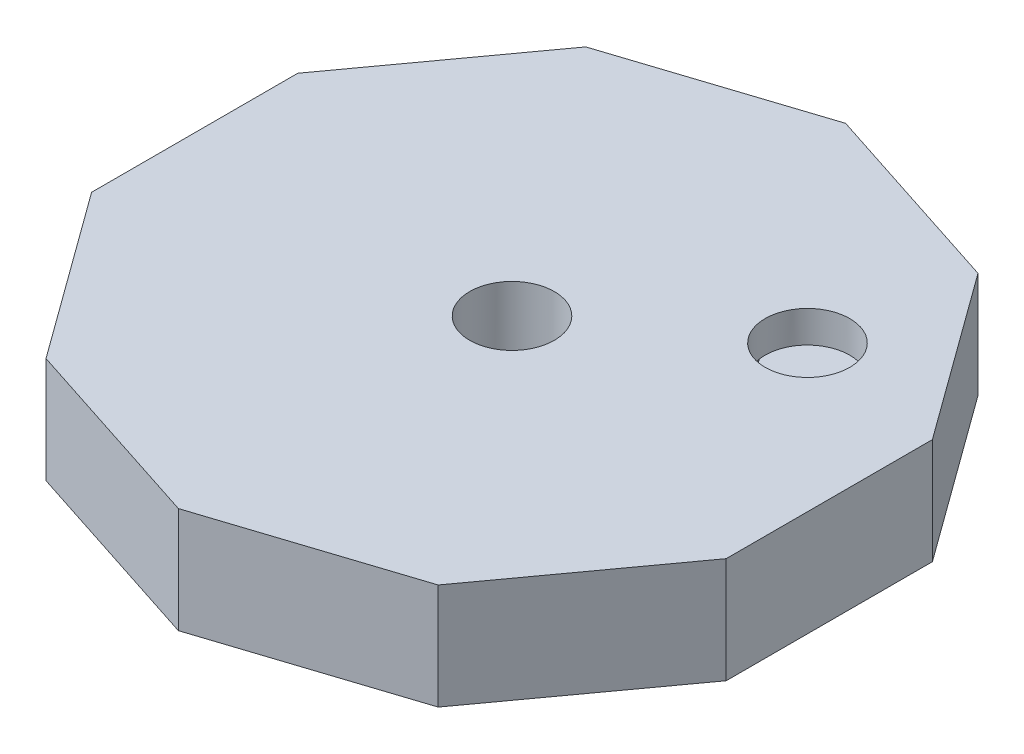
ISO-10303-21;
HEADER;
FILE_DESCRIPTION(('STEP AP214'),'2;1');
FILE_NAME('part.step','',(''),(''),'','','');
FILE_SCHEMA(('AUTOMOTIVE_DESIGN { 1 0 10303 214 1 1 1 1 }'));
ENDSEC;
DATA;
#1=APPLICATION_CONTEXT('core data for automotive mechanical design processes');
#2=APPLICATION_PROTOCOL_DEFINITION('international standard','automotive_design',2000,#1);
#3=PRODUCT_CONTEXT('',#1,'mechanical');
#4=PRODUCT('Part','Part','',(#3));
#5=PRODUCT_RELATED_PRODUCT_CATEGORY('part','',(#4));
#6=PRODUCT_DEFINITION_FORMATION('','',#4);
#7=PRODUCT_DEFINITION_CONTEXT('part definition',#1,'design');
#8=PRODUCT_DEFINITION('design','',#6,#7);
#9=PRODUCT_DEFINITION_SHAPE('','',#8);
#10=(LENGTH_UNIT() NAMED_UNIT(*) SI_UNIT(.MILLI.,.METRE.));
#11=(NAMED_UNIT(*) PLANE_ANGLE_UNIT() SI_UNIT($,.RADIAN.));
#12=(NAMED_UNIT(*) SI_UNIT($,.STERADIAN.) SOLID_ANGLE_UNIT());
#13=UNCERTAINTY_MEASURE_WITH_UNIT(LENGTH_MEASURE(1.E-05),#10,'distance_accuracy_value','');
#14=(GEOMETRIC_REPRESENTATION_CONTEXT(3) GLOBAL_UNCERTAINTY_ASSIGNED_CONTEXT((#13)) GLOBAL_UNIT_ASSIGNED_CONTEXT((#10,
#11,#12)) REPRESENTATION_CONTEXT('',''));
#15=CARTESIAN_POINT('',(0.,0.,0.));
#16=DIRECTION('',(0.,0.,1.));
#17=DIRECTION('',(1.,0.,0.));
#18=AXIS2_PLACEMENT_3D('',#15,#16,#17);
#19=CARTESIAN_POINT('',(12.360679774998,3.,0.));
#20=DIRECTION('',(0.,-1.,0.));
#21=DIRECTION('',(0.,0.,-1.));
#22=AXIS2_PLACEMENT_3D('',#19,#20,#21);
#23=PLANE('',#22);
#24=CARTESIAN_POINT('',(12.360679774998,3.,0.));
#25=DIRECTION('',(0.,-1.,0.));
#26=DIRECTION('',(0.,0.,-1.));
#27=AXIS2_PLACEMENT_3D('',#24,#25,#26);
#28=CIRCLE('',#27,2.);
#29=CARTESIAN_POINT('',(13.9787137637479,3.,-1.17557050458495));
#30=VERTEX_POINT('',#29);
#31=CARTESIAN_POINT('',(10.7426457862481,3.,1.17557050458495));
#32=VERTEX_POINT('',#31);
#33=EDGE_CURVE('E217',#30,#32,#28,.T.);
#34=ORIENTED_EDGE('',*,*,#33,.T.);
#35=DIRECTION('',(0.809016994374947,0.,-0.587785252292473));
#36=VECTOR('',#35,1.);
#37=CARTESIAN_POINT('',(12.360679774998,3.,0.));
#38=LINE('',#37,#36);
#39=EDGE_CURVE('E351',#32,#30,#38,.T.);
#40=ORIENTED_EDGE('',*,*,#39,.T.);
#41=EDGE_LOOP('',(#34,#40));
#42=FACE_BOUND('',#41,.T.);
#43=ADVANCED_FACE('F39',(#42),#23,.T.);
#44=CARTESIAN_POINT('',(0.,0.,0.));
#45=DIRECTION('',(0.,1.,0.));
#46=DIRECTION('',(0.,0.,1.));
#47=AXIS2_PLACEMENT_3D('',#44,#45,#46);
#48=CYLINDRICAL_SURFACE('',#47,2.);
#49=CARTESIAN_POINT('',(0.,5.,0.));
#50=DIRECTION('',(0.,1.,0.));
#51=DIRECTION('',(0.,0.,1.));
#52=AXIS2_PLACEMENT_3D('',#49,#50,#51);
#53=CIRCLE('',#52,2.);
#54=CARTESIAN_POINT('',(0.,5.,2.));
#55=VERTEX_POINT('',#54);
#56=EDGE_CURVE('E245',#55,#55,#53,.T.);
#57=ORIENTED_EDGE('',*,*,#56,.T.);
#58=EDGE_LOOP('',(#57));
#59=FACE_BOUND('',#58,.T.);
#60=CARTESIAN_POINT('',(0.,1.5,0.));
#61=DIRECTION('',(0.,-1.,0.));
#62=DIRECTION('',(0.,0.,-1.));
#63=AXIS2_PLACEMENT_3D('',#60,#61,#62);
#64=CIRCLE('',#63,2.);
#65=CARTESIAN_POINT('',(0.,1.5,-2.));
#66=VERTEX_POINT('',#65);
#67=EDGE_CURVE('E241',#66,#66,#64,.F.);
#68=ORIENTED_EDGE('',*,*,#67,.F.);
#69=EDGE_LOOP('',(#68));
#70=FACE_BOUND('',#69,.T.);
#71=ADVANCED_FACE('F398',(#59,#70),#48,.F.);
#72=CARTESIAN_POINT('',(9.27050983124844,5.,-12.7597621252807));
#73=DIRECTION('',(-0.309016994374947,0.,0.951056516295154));
#74=DIRECTION('',(0.951056516295154,0.,0.309016994374947));
#75=AXIS2_PLACEMENT_3D('',#72,#73,#74);
#76=PLANE('',#75);
#77=DIRECTION('',(-0.951056516295154,0.,-0.309016994374947));
#78=VECTOR('',#77,1.);
#79=CARTESIAN_POINT('',(9.27050983124844,0.,-12.7597621252807));
#80=LINE('',#79,#78);
#81=CARTESIAN_POINT('',(9.27050983124844,0.,-12.7597621252807));
#82=VERTEX_POINT('',#81);
#83=CARTESIAN_POINT('',(0.,0.,-15.7719333635741));
#84=VERTEX_POINT('',#83);
#85=EDGE_CURVE('E249',#82,#84,#80,.T.);
#86=ORIENTED_EDGE('',*,*,#85,.T.);
#87=DIRECTION('',(0.,-1.,0.));
#88=VECTOR('',#87,1.);
#89=CARTESIAN_POINT('',(0.,5.,-15.7719333635741));
#90=LINE('',#89,#88);
#91=CARTESIAN_POINT('',(0.,5.,-15.7719333635741));
#92=VERTEX_POINT('',#91);
#93=EDGE_CURVE('E347',#92,#84,#90,.T.);
#94=ORIENTED_EDGE('',*,*,#93,.F.);
#95=DIRECTION('',(-0.951056516295154,0.,-0.309016994374947));
#96=VECTOR('',#95,1.);
#97=CARTESIAN_POINT('',(9.27050983124844,5.,-12.7597621252807));
#98=LINE('',#97,#96);
#99=CARTESIAN_POINT('',(9.27050983124844,5.,-12.7597621252807));
#100=VERTEX_POINT('',#99);
#101=EDGE_CURVE('E250',#100,#92,#98,.T.);
#102=ORIENTED_EDGE('',*,*,#101,.F.);
#103=DIRECTION('',(0.,-1.,0.));
#104=VECTOR('',#103,1.);
#105=CARTESIAN_POINT('',(9.27050983124844,5.,-12.7597621252807));
#106=LINE('',#105,#104);
#107=EDGE_CURVE('E282',#100,#82,#106,.T.);
#108=ORIENTED_EDGE('',*,*,#107,.T.);
#109=EDGE_LOOP('',(#86,#94,#102,#108));
#110=FACE_BOUND('',#109,.T.);
#111=ADVANCED_FACE('F41',(#110),#76,.F.);
#112=CARTESIAN_POINT('',(0.,5.,-15.7719333635741));
#113=DIRECTION('',(0.309016994374948,0.,0.951056516295154));
#114=DIRECTION('',(0.951056516295154,0.,-0.309016994374948));
#115=AXIS2_PLACEMENT_3D('',#112,#113,#114);
#116=PLANE('',#115);
#117=DIRECTION('',(-0.951056516295154,0.,0.309016994374948));
#118=VECTOR('',#117,1.);
#119=CARTESIAN_POINT('',(0.,0.,-15.7719333635741));
#120=LINE('',#119,#118);
#121=CARTESIAN_POINT('',(-9.27050983124841,0.,-12.7597621252807));
#122=VERTEX_POINT('',#121);
#123=EDGE_CURVE('E286',#84,#122,#120,.T.);
#124=ORIENTED_EDGE('',*,*,#123,.T.);
#125=DIRECTION('',(0.,-1.,0.));
#126=VECTOR('',#125,1.);
#127=CARTESIAN_POINT('',(-9.27050983124841,5.,-12.7597621252807));
#128=LINE('',#127,#126);
#129=CARTESIAN_POINT('',(-9.27050983124841,5.,-12.7597621252807));
#130=VERTEX_POINT('',#129);
#131=EDGE_CURVE('E343',#130,#122,#128,.T.);
#132=ORIENTED_EDGE('',*,*,#131,.F.);
#133=DIRECTION('',(-0.951056516295154,0.,0.309016994374948));
#134=VECTOR('',#133,1.);
#135=CARTESIAN_POINT('',(0.,5.,-15.7719333635741));
#136=LINE('',#135,#134);
#137=EDGE_CURVE('E254',#92,#130,#136,.T.);
#138=ORIENTED_EDGE('',*,*,#137,.F.);
#139=ORIENTED_EDGE('',*,*,#93,.T.);
#140=EDGE_LOOP('',(#124,#132,#138,#139));
#141=FACE_BOUND('',#140,.T.);
#142=ADVANCED_FACE('F462',(#141),#116,.F.);
#143=CARTESIAN_POINT('',(-9.27050983124841,5.,-12.7597621252807));
#144=DIRECTION('',(0.809016994374947,0.,0.587785252292473));
#145=DIRECTION('',(0.587785252292473,0.,-0.809016994374948));
#146=AXIS2_PLACEMENT_3D('',#143,#144,#145);
#147=PLANE('',#146);
#148=DIRECTION('',(-0.587785252292473,0.,0.809016994374947));
#149=VECTOR('',#148,1.);
#150=CARTESIAN_POINT('',(-9.27050983124841,0.,-12.7597621252807));
#151=LINE('',#150,#149);
#152=CARTESIAN_POINT('',(-15.,0.,-4.87379544349371));
#153=VERTEX_POINT('',#152);
#154=EDGE_CURVE('E289',#122,#153,#151,.T.);
#155=ORIENTED_EDGE('',*,*,#154,.T.);
#156=DIRECTION('',(0.,-1.,0.));
#157=VECTOR('',#156,1.);
#158=CARTESIAN_POINT('',(-15.,5.,-4.87379544349371));
#159=LINE('',#158,#157);
#160=CARTESIAN_POINT('',(-15.,5.,-4.87379544349371));
#161=VERTEX_POINT('',#160);
#162=EDGE_CURVE('E339',#161,#153,#159,.T.);
#163=ORIENTED_EDGE('',*,*,#162,.F.);
#164=DIRECTION('',(-0.587785252292473,0.,0.809016994374947));
#165=VECTOR('',#164,1.);
#166=CARTESIAN_POINT('',(-9.27050983124841,5.,-12.7597621252807));
#167=LINE('',#166,#165);
#168=EDGE_CURVE('E258',#130,#161,#167,.T.);
#169=ORIENTED_EDGE('',*,*,#168,.F.);
#170=ORIENTED_EDGE('',*,*,#131,.T.);
#171=EDGE_LOOP('',(#155,#163,#169,#170));
#172=FACE_BOUND('',#171,.T.);
#173=ADVANCED_FACE('F459',(#172),#147,.F.);
#174=CARTESIAN_POINT('',(-15.,5.,-4.87379544349371));
#175=DIRECTION('',(1.,0.,0.));
#176=DIRECTION('',(0.,0.,-1.));
#177=AXIS2_PLACEMENT_3D('',#174,#175,#176);
#178=PLANE('',#177);
#179=DIRECTION('',(0.,0.,1.));
#180=VECTOR('',#179,1.);
#181=CARTESIAN_POINT('',(-15.,0.,-4.87379544349371));
#182=LINE('',#181,#180);
#183=CARTESIAN_POINT('',(-15.,0.,4.87379544349347));
#184=VERTEX_POINT('',#183);
#185=EDGE_CURVE('E292',#153,#184,#182,.T.);
#186=ORIENTED_EDGE('',*,*,#185,.T.);
#187=DIRECTION('',(0.,-1.,0.));
#188=VECTOR('',#187,1.);
#189=CARTESIAN_POINT('',(-15.,5.,4.87379544349347));
#190=LINE('',#189,#188);
#191=CARTESIAN_POINT('',(-15.,5.,4.87379544349347));
#192=VERTEX_POINT('',#191);
#193=EDGE_CURVE('E335',#192,#184,#190,.T.);
#194=ORIENTED_EDGE('',*,*,#193,.F.);
#195=DIRECTION('',(0.,0.,1.));
#196=VECTOR('',#195,1.);
#197=CARTESIAN_POINT('',(-15.,5.,-4.87379544349371));
#198=LINE('',#197,#196);
#199=EDGE_CURVE('E261',#161,#192,#198,.T.);
#200=ORIENTED_EDGE('',*,*,#199,.F.);
#201=ORIENTED_EDGE('',*,*,#162,.T.);
#202=EDGE_LOOP('',(#186,#194,#200,#201));
#203=FACE_BOUND('',#202,.T.);
#204=ADVANCED_FACE('F455',(#203),#178,.F.);
#205=CARTESIAN_POINT('',(-15.,5.,4.87379544349347));
#206=DIRECTION('',(0.809016994374947,0.,-0.587785252292473));
#207=DIRECTION('',(-0.587785252292473,0.,-0.809016994374948));
#208=AXIS2_PLACEMENT_3D('',#205,#206,#207);
#209=PLANE('',#208);
#210=DIRECTION('',(0.587785252292473,0.,0.809016994374947));
#211=VECTOR('',#210,1.);
#212=CARTESIAN_POINT('',(-15.,0.,4.87379544349347));
#213=LINE('',#212,#211);
#214=CARTESIAN_POINT('',(-9.2705098312484,0.,12.7597621252805));
#215=VERTEX_POINT('',#214);
#216=EDGE_CURVE('E295',#184,#215,#213,.T.);
#217=ORIENTED_EDGE('',*,*,#216,.T.);
#218=DIRECTION('',(0.,-1.,0.));
#219=VECTOR('',#218,1.);
#220=CARTESIAN_POINT('',(-9.2705098312484,5.,12.7597621252805));
#221=LINE('',#220,#219);
#222=CARTESIAN_POINT('',(-9.2705098312484,5.,12.7597621252805));
#223=VERTEX_POINT('',#222);
#224=EDGE_CURVE('E331',#223,#215,#221,.T.);
#225=ORIENTED_EDGE('',*,*,#224,.F.);
#226=DIRECTION('',(0.587785252292473,0.,0.809016994374947));
#227=VECTOR('',#226,1.);
#228=CARTESIAN_POINT('',(-15.,5.,4.87379544349347));
#229=LINE('',#228,#227);
#230=EDGE_CURVE('E264',#192,#223,#229,.T.);
#231=ORIENTED_EDGE('',*,*,#230,.F.);
#232=ORIENTED_EDGE('',*,*,#193,.T.);
#233=EDGE_LOOP('',(#217,#225,#231,#232));
#234=FACE_BOUND('',#233,.T.);
#235=ADVANCED_FACE('F451',(#234),#209,.F.);
#236=CARTESIAN_POINT('',(-9.2705098312484,5.,12.7597621252805));
#237=DIRECTION('',(0.309016994374947,0.,-0.951056516295154));
#238=DIRECTION('',(-0.951056516295154,0.,-0.309016994374947));
#239=AXIS2_PLACEMENT_3D('',#236,#237,#238);
#240=PLANE('',#239);
#241=DIRECTION('',(0.951056516295154,0.,0.309016994374947));
#242=VECTOR('',#241,1.);
#243=CARTESIAN_POINT('',(-9.2705098312484,0.,12.7597621252805));
#244=LINE('',#243,#242);
#245=CARTESIAN_POINT('',(0.,0.,15.7719333635739));
#246=VERTEX_POINT('',#245);
#247=EDGE_CURVE('E298',#215,#246,#244,.T.);
#248=ORIENTED_EDGE('',*,*,#247,.T.);
#249=DIRECTION('',(0.,-1.,0.));
#250=VECTOR('',#249,1.);
#251=CARTESIAN_POINT('',(0.,5.,15.7719333635739));
#252=LINE('',#251,#250);
#253=CARTESIAN_POINT('',(0.,5.,15.7719333635739));
#254=VERTEX_POINT('',#253);
#255=EDGE_CURVE('E327',#254,#246,#252,.T.);
#256=ORIENTED_EDGE('',*,*,#255,.F.);
#257=DIRECTION('',(0.951056516295154,0.,0.309016994374947));
#258=VECTOR('',#257,1.);
#259=CARTESIAN_POINT('',(-9.2705098312484,5.,12.7597621252805));
#260=LINE('',#259,#258);
#261=EDGE_CURVE('E267',#223,#254,#260,.T.);
#262=ORIENTED_EDGE('',*,*,#261,.F.);
#263=ORIENTED_EDGE('',*,*,#224,.T.);
#264=EDGE_LOOP('',(#248,#256,#262,#263));
#265=FACE_BOUND('',#264,.T.);
#266=ADVANCED_FACE('F447',(#265),#240,.F.);
#267=CARTESIAN_POINT('',(0.,5.,15.7719333635739));
#268=DIRECTION('',(-0.309016994374947,0.,-0.951056516295154));
#269=DIRECTION('',(-0.951056516295154,0.,0.309016994374947));
#270=AXIS2_PLACEMENT_3D('',#267,#268,#269);
#271=PLANE('',#270);
#272=DIRECTION('',(0.951056516295154,0.,-0.309016994374947));
#273=VECTOR('',#272,1.);
#274=CARTESIAN_POINT('',(0.,0.,15.7719333635739));
#275=LINE('',#274,#273);
#276=CARTESIAN_POINT('',(9.27050983124844,0.,12.7597621252805));
#277=VERTEX_POINT('',#276);
#278=EDGE_CURVE('E301',#246,#277,#275,.T.);
#279=ORIENTED_EDGE('',*,*,#278,.T.);
#280=DIRECTION('',(0.,-1.,0.));
#281=VECTOR('',#280,1.);
#282=CARTESIAN_POINT('',(9.27050983124844,5.,12.7597621252805));
#283=LINE('',#282,#281);
#284=CARTESIAN_POINT('',(9.27050983124844,5.,12.7597621252805));
#285=VERTEX_POINT('',#284);
#286=EDGE_CURVE('E323',#285,#277,#283,.T.);
#287=ORIENTED_EDGE('',*,*,#286,.F.);
#288=DIRECTION('',(0.951056516295154,0.,-0.309016994374947));
#289=VECTOR('',#288,1.);
#290=CARTESIAN_POINT('',(0.,5.,15.7719333635739));
#291=LINE('',#290,#289);
#292=EDGE_CURVE('E270',#254,#285,#291,.T.);
#293=ORIENTED_EDGE('',*,*,#292,.F.);
#294=ORIENTED_EDGE('',*,*,#255,.T.);
#295=EDGE_LOOP('',(#279,#287,#293,#294));
#296=FACE_BOUND('',#295,.T.);
#297=ADVANCED_FACE('F443',(#296),#271,.F.);
#298=CARTESIAN_POINT('',(9.27050983124844,5.,12.7597621252805));
#299=DIRECTION('',(-0.809016994374947,0.,-0.587785252292473));
#300=DIRECTION('',(-0.587785252292473,0.,0.809016994374948));
#301=AXIS2_PLACEMENT_3D('',#298,#299,#300);
#302=PLANE('',#301);
#303=DIRECTION('',(0.587785252292473,0.,-0.809016994374947));
#304=VECTOR('',#303,1.);
#305=CARTESIAN_POINT('',(9.27050983124844,0.,12.7597621252805));
#306=LINE('',#305,#304);
#307=CARTESIAN_POINT('',(15.,0.,4.87379544349347));
#308=VERTEX_POINT('',#307);
#309=EDGE_CURVE('E304',#277,#308,#306,.T.);
#310=ORIENTED_EDGE('',*,*,#309,.T.);
#311=DIRECTION('',(0.,-1.,0.));
#312=VECTOR('',#311,1.);
#313=CARTESIAN_POINT('',(15.,5.,4.87379544349347));
#314=LINE('',#313,#312);
#315=CARTESIAN_POINT('',(15.,5.,4.87379544349347));
#316=VERTEX_POINT('',#315);
#317=EDGE_CURVE('E319',#316,#308,#314,.T.);
#318=ORIENTED_EDGE('',*,*,#317,.F.);
#319=DIRECTION('',(0.587785252292473,0.,-0.809016994374947));
#320=VECTOR('',#319,1.);
#321=CARTESIAN_POINT('',(9.27050983124844,5.,12.7597621252805));
#322=LINE('',#321,#320);
#323=EDGE_CURVE('E273',#285,#316,#322,.T.);
#324=ORIENTED_EDGE('',*,*,#323,.F.);
#325=ORIENTED_EDGE('',*,*,#286,.T.);
#326=EDGE_LOOP('',(#310,#318,#324,#325));
#327=FACE_BOUND('',#326,.T.);
#328=ADVANCED_FACE('F439',(#327),#302,.F.);
#329=CARTESIAN_POINT('',(15.,5.,4.87379544349347));
#330=DIRECTION('',(-1.,0.,0.));
#331=DIRECTION('',(0.,0.,1.));
#332=AXIS2_PLACEMENT_3D('',#329,#330,#331);
#333=PLANE('',#332);
#334=DIRECTION('',(0.,0.,-1.));
#335=VECTOR('',#334,1.);
#336=CARTESIAN_POINT('',(15.,0.,4.87379544349347));
#337=LINE('',#336,#335);
#338=CARTESIAN_POINT('',(15.,0.,-4.87379544349372));
#339=VERTEX_POINT('',#338);
#340=EDGE_CURVE('E307',#308,#339,#337,.T.);
#341=ORIENTED_EDGE('',*,*,#340,.T.);
#342=DIRECTION('',(0.,-1.,0.));
#343=VECTOR('',#342,1.);
#344=CARTESIAN_POINT('',(15.,5.,-4.87379544349372));
#345=LINE('',#344,#343);
#346=CARTESIAN_POINT('',(15.,5.,-4.87379544349372));
#347=VERTEX_POINT('',#346);
#348=EDGE_CURVE('E315',#347,#339,#345,.T.);
#349=ORIENTED_EDGE('',*,*,#348,.F.);
#350=DIRECTION('',(0.,0.,-1.));
#351=VECTOR('',#350,1.);
#352=CARTESIAN_POINT('',(15.,5.,4.87379544349347));
#353=LINE('',#352,#351);
#354=EDGE_CURVE('E276',#316,#347,#353,.T.);
#355=ORIENTED_EDGE('',*,*,#354,.F.);
#356=ORIENTED_EDGE('',*,*,#317,.T.);
#357=EDGE_LOOP('',(#341,#349,#355,#356));
#358=FACE_BOUND('',#357,.T.);
#359=ADVANCED_FACE('F435',(#358),#333,.F.);
#360=CARTESIAN_POINT('',(15.,5.,-4.87379544349372));
#361=DIRECTION('',(-0.809016994374947,0.,0.587785252292473));
#362=DIRECTION('',(0.587785252292473,0.,0.809016994374947));
#363=AXIS2_PLACEMENT_3D('',#360,#361,#362);
#364=PLANE('',#363);
#365=DIRECTION('',(-0.587785252292473,0.,-0.809016994374947));
#366=VECTOR('',#365,1.);
#367=CARTESIAN_POINT('',(15.,0.,-4.87379544349372));
#368=LINE('',#367,#366);
#369=EDGE_CURVE('E255',#339,#82,#368,.T.);
#370=ORIENTED_EDGE('',*,*,#369,.T.);
#371=ORIENTED_EDGE('',*,*,#107,.F.);
#372=DIRECTION('',(-0.587785252292473,0.,-0.809016994374947));
#373=VECTOR('',#372,1.);
#374=CARTESIAN_POINT('',(15.,5.,-4.87379544349372));
#375=LINE('',#374,#373);
#376=EDGE_CURVE('E279',#347,#100,#375,.T.);
#377=ORIENTED_EDGE('',*,*,#376,.F.);
#378=ORIENTED_EDGE('',*,*,#348,.T.);
#379=EDGE_LOOP('',(#370,#371,#377,#378));
#380=FACE_BOUND('',#379,.T.);
#381=ADVANCED_FACE('F428',(#380),#364,.F.);
#382=CARTESIAN_POINT('',(0.,5.,0.));
#383=DIRECTION('',(0.,1.,0.));
#384=DIRECTION('',(0.,0.,1.));
#385=AXIS2_PLACEMENT_3D('',#382,#383,#384);
#386=PLANE('',#385);
#387=CARTESIAN_POINT('',(8.09016994374954,5.,-5.87785252292479));
#388=DIRECTION('',(0.,1.,0.));
#389=DIRECTION('',(0.,0.,1.));
#390=AXIS2_PLACEMENT_3D('',#387,#388,#389);
#391=CIRCLE('',#390,2.);
#392=CARTESIAN_POINT('',(8.09016994374954,5.,-3.87785252292479));
#393=VERTEX_POINT('',#392);
#394=EDGE_CURVE('E221',#393,#393,#391,.T.);
#395=ORIENTED_EDGE('',*,*,#394,.F.);
#396=EDGE_LOOP('',(#395));
#397=FACE_BOUND('',#396,.T.);
#398=ORIENTED_EDGE('',*,*,#56,.F.);
#399=EDGE_LOOP('',(#398));
#400=FACE_BOUND('',#399,.T.);
#401=ORIENTED_EDGE('',*,*,#101,.T.);
#402=ORIENTED_EDGE('',*,*,#137,.T.);
#403=ORIENTED_EDGE('',*,*,#168,.T.);
#404=ORIENTED_EDGE('',*,*,#199,.T.);
#405=ORIENTED_EDGE('',*,*,#230,.T.);
#406=ORIENTED_EDGE('',*,*,#261,.T.);
#407=ORIENTED_EDGE('',*,*,#292,.T.);
#408=ORIENTED_EDGE('',*,*,#323,.T.);
#409=ORIENTED_EDGE('',*,*,#354,.T.);
#410=ORIENTED_EDGE('',*,*,#376,.T.);
#411=EDGE_LOOP('',(#401,#402,#403,#404,#405,#406,#407,#408,#409,#410));
#412=FACE_BOUND('',#411,.T.);
#413=ADVANCED_FACE('F425',(#397,#400,#412),#386,.T.);
#414=CARTESIAN_POINT('',(0.,0.,0.));
#415=DIRECTION('',(0.,1.,0.));
#416=DIRECTION('',(0.,0.,1.));
#417=AXIS2_PLACEMENT_3D('',#414,#415,#416);
#418=PLANE('',#417);
#419=CARTESIAN_POINT('',(12.360679774998,0.,0.));
#420=DIRECTION('',(0.,-1.,0.));
#421=DIRECTION('',(0.,0.,-1.));
#422=AXIS2_PLACEMENT_3D('',#419,#420,#421);
#423=CIRCLE('',#422,2.);
#424=CARTESIAN_POINT('',(12.360679774998,0.,-2.));
#425=VERTEX_POINT('',#424);
#426=EDGE_CURVE('E222',#425,#425,#423,.T.);
#427=ORIENTED_EDGE('',*,*,#426,.F.);
#428=EDGE_LOOP('',(#427));
#429=FACE_BOUND('',#428,.T.);
#430=CARTESIAN_POINT('',(3.81966011250107,0.,-11.7557050458496));
#431=DIRECTION('',(0.,-1.,0.));
#432=DIRECTION('',(0.,0.,-1.));
#433=AXIS2_PLACEMENT_3D('',#430,#431,#432);
#434=CIRCLE('',#433,2.);
#435=CARTESIAN_POINT('',(3.81966011250107,0.,-13.7557050458496));
#436=VERTEX_POINT('',#435);
#437=EDGE_CURVE('E226',#436,#436,#434,.T.);
#438=ORIENTED_EDGE('',*,*,#437,.F.);
#439=EDGE_LOOP('',(#438));
#440=FACE_BOUND('',#439,.T.);
#441=CARTESIAN_POINT('',(0.,0.,0.));
#442=DIRECTION('',(0.,-1.,0.));
#443=DIRECTION('',(0.,0.,-1.));
#444=AXIS2_PLACEMENT_3D('',#441,#442,#443);
#445=CIRCLE('',#444,3.);
#446=CARTESIAN_POINT('',(0.,0.,-3.));
#447=VERTEX_POINT('',#446);
#448=EDGE_CURVE('E236',#447,#447,#445,.T.);
#449=ORIENTED_EDGE('',*,*,#448,.F.);
#450=EDGE_LOOP('',(#449));
#451=FACE_BOUND('',#450,.T.);
#452=ORIENTED_EDGE('',*,*,#85,.F.);
#453=ORIENTED_EDGE('',*,*,#369,.F.);
#454=ORIENTED_EDGE('',*,*,#340,.F.);
#455=ORIENTED_EDGE('',*,*,#309,.F.);
#456=ORIENTED_EDGE('',*,*,#278,.F.);
#457=ORIENTED_EDGE('',*,*,#247,.F.);
#458=ORIENTED_EDGE('',*,*,#216,.F.);
#459=ORIENTED_EDGE('',*,*,#185,.F.);
#460=ORIENTED_EDGE('',*,*,#154,.F.);
#461=ORIENTED_EDGE('',*,*,#123,.F.);
#462=EDGE_LOOP('',(#452,#453,#454,#455,#456,#457,#458,#459,#460,#461));
#463=FACE_BOUND('',#462,.T.);
#464=ADVANCED_FACE('F420',(#429,#440,#451,#463),#418,.F.);
#465=CARTESIAN_POINT('',(0.,1.5,0.));
#466=DIRECTION('',(0.,-1.,0.));
#467=DIRECTION('',(0.,0.,-1.));
#468=AXIS2_PLACEMENT_3D('',#465,#466,#467);
#469=PLANE('',#468);
#470=CARTESIAN_POINT('',(0.,1.5,0.));
#471=DIRECTION('',(0.,-1.,0.));
#472=DIRECTION('',(0.,0.,-1.));
#473=AXIS2_PLACEMENT_3D('',#470,#471,#472);
#474=CIRCLE('',#473,3.);
#475=CARTESIAN_POINT('',(0.,1.5,-3.));
#476=VERTEX_POINT('',#475);
#477=EDGE_CURVE('E237',#476,#476,#474,.T.);
#478=ORIENTED_EDGE('',*,*,#477,.T.);
#479=EDGE_LOOP('',(#478));
#480=FACE_BOUND('',#479,.T.);
#481=ORIENTED_EDGE('',*,*,#67,.T.);
#482=EDGE_LOOP('',(#481));
#483=FACE_BOUND('',#482,.T.);
#484=ADVANCED_FACE('F417',(#480,#483),#469,.T.);
#485=CARTESIAN_POINT('',(0.,1.5,0.));
#486=DIRECTION('',(0.,-1.,0.));
#487=DIRECTION('',(0.,0.,-1.));
#488=AXIS2_PLACEMENT_3D('',#485,#486,#487);
#489=CYLINDRICAL_SURFACE('',#488,3.);
#490=ORIENTED_EDGE('',*,*,#477,.F.);
#491=EDGE_LOOP('',(#490));
#492=FACE_BOUND('',#491,.T.);
#493=ORIENTED_EDGE('',*,*,#448,.T.);
#494=EDGE_LOOP('',(#493));
#495=FACE_BOUND('',#494,.T.);
#496=ADVANCED_FACE('F416',(#492,#495),#489,.F.);
#497=CARTESIAN_POINT('',(8.09016994374954,3.,-5.87785252292479));
#498=DIRECTION('',(0.,1.,0.));
#499=DIRECTION('',(0.,0.,1.));
#500=AXIS2_PLACEMENT_3D('',#497,#498,#499);
#501=CYLINDRICAL_SURFACE('',#500,2.);
#502=CARTESIAN_POINT('',(8.09016994374954,3.5,-5.87785252292479));
#503=DIRECTION('',(0.,1.,0.));
#504=DIRECTION('',(0.,0.,1.));
#505=AXIS2_PLACEMENT_3D('',#502,#503,#504);
#506=CIRCLE('',#505,2.);
#507=CARTESIAN_POINT('',(9.70820393249944,3.5,-7.05342302750975));
#508=VERTEX_POINT('',#507);
#509=CARTESIAN_POINT('',(6.47213595499965,3.5,-4.70228201833985));
#510=VERTEX_POINT('',#509);
#511=EDGE_CURVE('E43',#508,#510,#506,.F.);
#512=ORIENTED_EDGE('',*,*,#511,.T.);
#513=EDGE_CURVE('E11',#510,#508,#506,.F.);
#514=ORIENTED_EDGE('',*,*,#513,.T.);
#515=EDGE_LOOP('',(#512,#514));
#516=FACE_BOUND('',#515,.T.);
#517=ORIENTED_EDGE('',*,*,#394,.T.);
#518=EDGE_LOOP('',(#517));
#519=FACE_BOUND('',#518,.T.);
#520=ADVANCED_FACE('F364',(#516,#519),#501,.F.);
#521=CARTESIAN_POINT('',(3.81966011250107,3.,-11.7557050458496));
#522=DIRECTION('',(0.,-1.,0.));
#523=DIRECTION('',(0.,0.,-1.));
#524=AXIS2_PLACEMENT_3D('',#521,#522,#523);
#525=CYLINDRICAL_SURFACE('',#524,2.);
#526=CARTESIAN_POINT('',(3.81966011250107,3.,-11.7557050458496));
#527=DIRECTION('',(0.,-1.,0.));
#528=DIRECTION('',(0.,0.,-1.));
#529=AXIS2_PLACEMENT_3D('',#526,#527,#528);
#530=CIRCLE('',#529,2.);
#531=CARTESIAN_POINT('',(2.20162612375118,3.,-10.5801345412646));
#532=VERTEX_POINT('',#531);
#533=CARTESIAN_POINT('',(5.43769410125098,3.,-12.9312755504345));
#534=VERTEX_POINT('',#533);
#535=EDGE_CURVE('E216',#532,#534,#530,.T.);
#536=ORIENTED_EDGE('',*,*,#535,.F.);
#537=DIRECTION('',(0.,1.,0.));
#538=VECTOR('',#537,1.);
#539=CARTESIAN_POINT('',(2.20162612375119,2.5,-10.5801345412646));
#540=LINE('',#539,#538);
#541=CARTESIAN_POINT('',(2.20162612375119,2.5,-10.5801345412646));
#542=VERTEX_POINT('',#541);
#543=EDGE_CURVE('E61',#542,#532,#540,.T.);
#544=ORIENTED_EDGE('',*,*,#543,.F.);
#545=CARTESIAN_POINT('',(3.81966011250107,2.5,-11.7557050458496));
#546=DIRECTION('',(0.,1.,0.));
#547=DIRECTION('',(0.,0.,1.));
#548=AXIS2_PLACEMENT_3D('',#545,#546,#547);
#549=CIRCLE('',#548,2.);
#550=CARTESIAN_POINT('',(5.43769410125098,2.5,-12.9312755504345));
#551=VERTEX_POINT('',#550);
#552=EDGE_CURVE('E212',#551,#542,#549,.F.);
#553=ORIENTED_EDGE('',*,*,#552,.F.);
#554=DIRECTION('',(0.,1.,0.));
#555=VECTOR('',#554,1.);
#556=CARTESIAN_POINT('',(5.43769410125098,2.5,-12.9312755504345));
#557=LINE('',#556,#555);
#558=EDGE_CURVE('E169',#551,#534,#557,.T.);
#559=ORIENTED_EDGE('',*,*,#558,.T.);
#560=EDGE_LOOP('',(#536,#544,#553,#559));
#561=FACE_BOUND('',#560,.T.);
#562=ORIENTED_EDGE('',*,*,#437,.T.);
#563=EDGE_LOOP('',(#562));
#564=FACE_BOUND('',#563,.T.);
#565=ADVANCED_FACE('F379',(#561,#564),#525,.F.);
#566=CARTESIAN_POINT('',(3.81966011250107,3.,-11.7557050458496));
#567=DIRECTION('',(0.,-1.,0.));
#568=DIRECTION('',(0.,0.,-1.));
#569=AXIS2_PLACEMENT_3D('',#566,#567,#568);
#570=PLANE('',#569);
#571=DIRECTION('',(0.809016994374947,0.,-0.587785252292473));
#572=VECTOR('',#571,1.);
#573=CARTESIAN_POINT('',(3.81966011250107,3.,-11.7557050458496));
#574=LINE('',#573,#572);
#575=EDGE_CURVE('E164',#532,#534,#574,.T.);
#576=ORIENTED_EDGE('',*,*,#575,.F.);
#577=ORIENTED_EDGE('',*,*,#535,.T.);
#578=EDGE_LOOP('',(#576,#577));
#579=FACE_BOUND('',#578,.T.);
#580=ADVANCED_FACE('F377',(#579),#570,.T.);
#581=CARTESIAN_POINT('',(12.360679774998,3.,0.));
#582=DIRECTION('',(0.,-1.,0.));
#583=DIRECTION('',(0.,0.,-1.));
#584=AXIS2_PLACEMENT_3D('',#581,#582,#583);
#585=CYLINDRICAL_SURFACE('',#584,2.);
#586=CARTESIAN_POINT('',(12.360679774998,2.5,0.));
#587=DIRECTION('',(0.,1.,0.));
#588=DIRECTION('',(0.,0.,1.));
#589=AXIS2_PLACEMENT_3D('',#586,#587,#588);
#590=CIRCLE('',#589,2.);
#591=CARTESIAN_POINT('',(10.7426457862481,2.5,1.17557050458495));
#592=VERTEX_POINT('',#591);
#593=CARTESIAN_POINT('',(13.9787137637479,2.5,-1.17557050458494));
#594=VERTEX_POINT('',#593);
#595=EDGE_CURVE('E358',#592,#594,#590,.F.);
#596=ORIENTED_EDGE('',*,*,#595,.F.);
#597=DIRECTION('',(0.,1.,0.));
#598=VECTOR('',#597,1.);
#599=CARTESIAN_POINT('',(10.7426457862481,2.5,1.17557050458495));
#600=LINE('',#599,#598);
#601=EDGE_CURVE('E204',#592,#32,#600,.T.);
#602=ORIENTED_EDGE('',*,*,#601,.T.);
#603=ORIENTED_EDGE('',*,*,#33,.F.);
#604=DIRECTION('',(0.,1.,0.));
#605=VECTOR('',#604,1.);
#606=CARTESIAN_POINT('',(13.9787137637479,2.5,-1.17557050458494));
#607=LINE('',#606,#605);
#608=EDGE_CURVE('E189',#594,#30,#607,.T.);
#609=ORIENTED_EDGE('',*,*,#608,.F.);
#610=EDGE_LOOP('',(#596,#602,#603,#609));
#611=FACE_BOUND('',#610,.T.);
#612=ORIENTED_EDGE('',*,*,#426,.T.);
#613=EDGE_LOOP('',(#612));
#614=FACE_BOUND('',#613,.T.);
#615=ADVANCED_FACE('F390',(#611,#614),#585,.F.);
#616=CARTESIAN_POINT('',(2.20162612375119,3.5,-10.5801345412646));
#617=DIRECTION('',(0.,1.,0.));
#618=DIRECTION('',(0.,0.,1.));
#619=AXIS2_PLACEMENT_3D('',#616,#617,#618);
#620=PLANE('',#619);
#621=DIRECTION('',(0.587785252292473,0.,0.809016994374947));
#622=VECTOR('',#621,1.);
#623=CARTESIAN_POINT('',(2.20162612375119,3.5,-10.5801345412646));
#624=LINE('',#623,#622);
#625=CARTESIAN_POINT('',(2.20162612375119,3.5,-10.5801345412646));
#626=VERTEX_POINT('',#625);
#627=EDGE_CURVE('E55',#626,#510,#624,.T.);
#628=ORIENTED_EDGE('',*,*,#627,.F.);
#629=DIRECTION('',(0.809016994374947,0.,-0.587785252292473));
#630=VECTOR('',#629,1.);
#631=CARTESIAN_POINT('',(2.20162612375119,3.5,-10.5801345412646));
#632=LINE('',#631,#630);
#633=CARTESIAN_POINT('',(5.43769410125098,3.5,-12.9312755504345));
#634=VERTEX_POINT('',#633);
#635=EDGE_CURVE('E162',#626,#634,#632,.T.);
#636=ORIENTED_EDGE('',*,*,#635,.T.);
#637=DIRECTION('',(0.587785252292473,0.,0.809016994374947));
#638=VECTOR('',#637,1.);
#639=CARTESIAN_POINT('',(5.43769410125098,3.5,-12.9312755504345));
#640=LINE('',#639,#638);
#641=EDGE_CURVE('E175',#634,#508,#640,.T.);
#642=ORIENTED_EDGE('',*,*,#641,.T.);
#643=ORIENTED_EDGE('',*,*,#513,.F.);
#644=EDGE_LOOP('',(#628,#636,#642,#643));
#645=FACE_BOUND('',#644,.T.);
#646=ADVANCED_FACE('F173',(#645),#620,.F.);
#647=CARTESIAN_POINT('',(13.9787137637479,3.5,-1.17557050458494));
#648=VERTEX_POINT('',#647);
#649=EDGE_CURVE('E183',#508,#648,#640,.T.);
#650=ORIENTED_EDGE('',*,*,#649,.T.);
#651=DIRECTION('',(0.809016994374947,0.,-0.587785252292473));
#652=VECTOR('',#651,1.);
#653=CARTESIAN_POINT('',(10.7426457862481,3.5,1.17557050458495));
#654=LINE('',#653,#652);
#655=CARTESIAN_POINT('',(10.7426457862481,3.5,1.17557050458495));
#656=VERTEX_POINT('',#655);
#657=EDGE_CURVE('E177',#656,#648,#654,.T.);
#658=ORIENTED_EDGE('',*,*,#657,.F.);
#659=EDGE_CURVE('E200',#510,#656,#624,.T.);
#660=ORIENTED_EDGE('',*,*,#659,.F.);
#661=ORIENTED_EDGE('',*,*,#511,.F.);
#662=EDGE_LOOP('',(#650,#658,#660,#661));
#663=FACE_BOUND('',#662,.T.);
#664=ADVANCED_FACE('F367',(#663),#620,.F.);
#665=CARTESIAN_POINT('',(2.20162612375119,2.5,-10.5801345412646));
#666=DIRECTION('',(0.,1.,0.));
#667=DIRECTION('',(0.,0.,1.));
#668=AXIS2_PLACEMENT_3D('',#665,#666,#667);
#669=PLANE('',#668);
#670=ORIENTED_EDGE('',*,*,#552,.T.);
#671=DIRECTION('',(0.587785252292473,0.,0.809016994374947));
#672=VECTOR('',#671,1.);
#673=CARTESIAN_POINT('',(2.20162612375119,2.5,-10.5801345412646));
#674=LINE('',#673,#672);
#675=EDGE_CURVE('E178',#542,#592,#674,.T.);
#676=ORIENTED_EDGE('',*,*,#675,.T.);
#677=ORIENTED_EDGE('',*,*,#595,.T.);
#678=DIRECTION('',(0.587785252292473,0.,0.809016994374947));
#679=VECTOR('',#678,1.);
#680=CARTESIAN_POINT('',(5.43769410125098,2.5,-12.9312755504345));
#681=LINE('',#680,#679);
#682=EDGE_CURVE('E193',#551,#594,#681,.T.);
#683=ORIENTED_EDGE('',*,*,#682,.F.);
#684=EDGE_LOOP('',(#670,#676,#677,#683));
#685=FACE_BOUND('',#684,.T.);
#686=ADVANCED_FACE('F386',(#685),#669,.T.);
#687=CARTESIAN_POINT('',(2.20162612375119,2.5,-10.5801345412646));
#688=DIRECTION('',(-0.587785252292473,0.,-0.809016994374947));
#689=DIRECTION('',(-0.809016994374947,0.,0.587785252292473));
#690=AXIS2_PLACEMENT_3D('',#687,#688,#689);
#691=PLANE('',#690);
#692=ORIENTED_EDGE('',*,*,#575,.T.);
#693=EDGE_CURVE('E159',#534,#634,#557,.T.);
#694=ORIENTED_EDGE('',*,*,#693,.T.);
#695=ORIENTED_EDGE('',*,*,#635,.F.);
#696=EDGE_CURVE('E197',#532,#626,#540,.T.);
#697=ORIENTED_EDGE('',*,*,#696,.F.);
#698=EDGE_LOOP('',(#692,#694,#695,#697));
#699=FACE_BOUND('',#698,.T.);
#700=ADVANCED_FACE('F161',(#699),#691,.F.);
#701=CARTESIAN_POINT('',(10.7426457862481,2.5,1.17557050458495));
#702=DIRECTION('',(-0.587785252292473,0.,-0.809016994374947));
#703=DIRECTION('',(-0.809016994374947,0.,0.587785252292473));
#704=AXIS2_PLACEMENT_3D('',#701,#702,#703);
#705=PLANE('',#704);
#706=EDGE_CURVE('E203',#32,#656,#600,.T.);
#707=ORIENTED_EDGE('',*,*,#706,.T.);
#708=ORIENTED_EDGE('',*,*,#657,.T.);
#709=EDGE_CURVE('E185',#30,#648,#607,.T.);
#710=ORIENTED_EDGE('',*,*,#709,.F.);
#711=ORIENTED_EDGE('',*,*,#39,.F.);
#712=EDGE_LOOP('',(#707,#708,#710,#711));
#713=FACE_BOUND('',#712,.T.);
#714=ADVANCED_FACE('F395',(#713),#705,.T.);
#715=CARTESIAN_POINT('',(6.47213595499966,0.,-4.70228201833984));
#716=DIRECTION('',(0.809016994374948,0.,-0.587785252292473));
#717=DIRECTION('',(-0.587785252292473,0.,-0.809016994374947));
#718=AXIS2_PLACEMENT_3D('',#715,#716,#717);
#719=PLANE('',#718);
#720=ORIENTED_EDGE('',*,*,#543,.T.);
#721=ORIENTED_EDGE('',*,*,#696,.T.);
#722=ORIENTED_EDGE('',*,*,#627,.T.);
#723=ORIENTED_EDGE('',*,*,#659,.T.);
#724=ORIENTED_EDGE('',*,*,#706,.F.);
#725=ORIENTED_EDGE('',*,*,#601,.F.);
#726=ORIENTED_EDGE('',*,*,#675,.F.);
#727=EDGE_LOOP('',(#720,#721,#722,#723,#724,#725,#726));
#728=FACE_BOUND('',#727,.T.);
#729=ADVANCED_FACE('F374',(#728),#719,.T.);
#730=CARTESIAN_POINT('',(9.70820393249945,0.,-7.05342302750974));
#731=DIRECTION('',(0.809016994374948,0.,-0.587785252292473));
#732=DIRECTION('',(-0.587785252292473,0.,-0.809016994374947));
#733=AXIS2_PLACEMENT_3D('',#730,#731,#732);
#734=PLANE('',#733);
#735=ORIENTED_EDGE('',*,*,#558,.F.);
#736=ORIENTED_EDGE('',*,*,#682,.T.);
#737=ORIENTED_EDGE('',*,*,#608,.T.);
#738=ORIENTED_EDGE('',*,*,#709,.T.);
#739=ORIENTED_EDGE('',*,*,#649,.F.);
#740=ORIENTED_EDGE('',*,*,#641,.F.);
#741=ORIENTED_EDGE('',*,*,#693,.F.);
#742=EDGE_LOOP('',(#735,#736,#737,#738,#739,#740,#741));
#743=FACE_BOUND('',#742,.T.);
#744=ADVANCED_FACE('F181',(#743),#734,.F.);
#745=CLOSED_SHELL('',(#43,#71,#111,#142,#173,#204,#235,#266,#297,#328,#359,#381,#413,#464,#484,
#496,#520,#565,#580,#615,#646,#664,#686,#700,#714,#729,#744));
#746=MANIFOLD_SOLID_BREP('B2',#745);
#747=ADVANCED_BREP_SHAPE_REPRESENTATION('',(#18,#746),#14);
#748=SHAPE_DEFINITION_REPRESENTATION(#9,#747);
ENDSEC;
END-ISO-10303-21;
